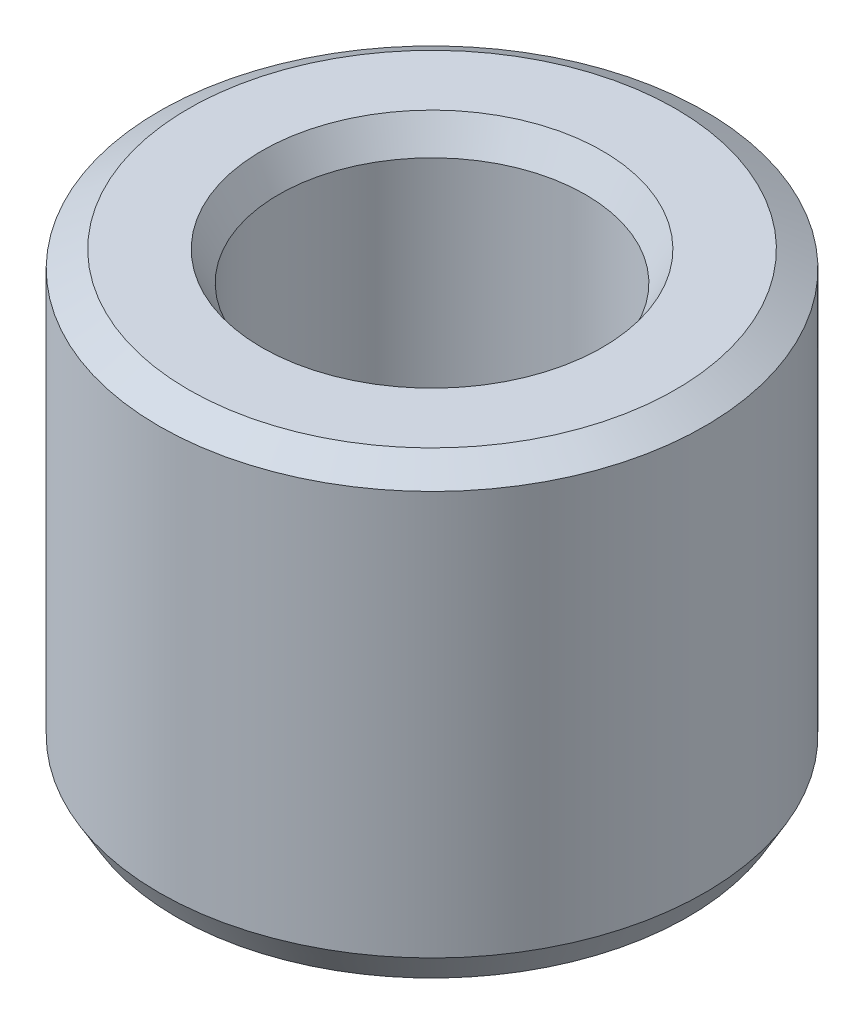
ISO-10303-21;
HEADER;
FILE_DESCRIPTION(('STEP AP214'),'2;1');
FILE_NAME('part.step','',(''),(''),'','','');
FILE_SCHEMA(('AUTOMOTIVE_DESIGN { 1 0 10303 214 1 1 1 1 }'));
ENDSEC;
DATA;
#1=APPLICATION_CONTEXT('core data for automotive mechanical design processes');
#2=APPLICATION_PROTOCOL_DEFINITION('international standard','automotive_design',2000,#1);
#3=PRODUCT_CONTEXT('',#1,'mechanical');
#4=PRODUCT('Part','Part','',(#3));
#5=PRODUCT_RELATED_PRODUCT_CATEGORY('part','',(#4));
#6=PRODUCT_DEFINITION_FORMATION('','',#4);
#7=PRODUCT_DEFINITION_CONTEXT('part definition',#1,'design');
#8=PRODUCT_DEFINITION('design','',#6,#7);
#9=PRODUCT_DEFINITION_SHAPE('','',#8);
#10=(LENGTH_UNIT() NAMED_UNIT(*) SI_UNIT(.MILLI.,.METRE.));
#11=(NAMED_UNIT(*) PLANE_ANGLE_UNIT() SI_UNIT($,.RADIAN.));
#12=(NAMED_UNIT(*) SI_UNIT($,.STERADIAN.) SOLID_ANGLE_UNIT());
#13=UNCERTAINTY_MEASURE_WITH_UNIT(LENGTH_MEASURE(1.E-05),#10,'distance_accuracy_value','');
#14=(GEOMETRIC_REPRESENTATION_CONTEXT(3) GLOBAL_UNCERTAINTY_ASSIGNED_CONTEXT((#13)) GLOBAL_UNIT_ASSIGNED_CONTEXT((#10,
#11,#12)) REPRESENTATION_CONTEXT('',''));
#15=CARTESIAN_POINT('',(0.,0.,0.));
#16=DIRECTION('',(0.,0.,1.));
#17=DIRECTION('',(1.,0.,0.));
#18=AXIS2_PLACEMENT_3D('',#15,#16,#17);
#19=CARTESIAN_POINT('',(0.,78.3973952049139,0.));
#20=DIRECTION('',(0.,-1.,0.));
#21=DIRECTION('',(0.,0.,-1.));
#22=AXIS2_PLACEMENT_3D('',#19,#20,#21);
#23=CYLINDRICAL_SURFACE('',#22,47.5);
#24=CARTESIAN_POINT('',(0.,5.11065003332639,0.));
#25=DIRECTION('',(0.,1.,0.));
#26=DIRECTION('',(0.,0.,1.));
#27=AXIS2_PLACEMENT_3D('',#24,#25,#26);
#28=CIRCLE('',#27,47.5);
#29=CARTESIAN_POINT('',(0.,5.11065003332639,47.5));
#30=VERTEX_POINT('',#29);
#31=EDGE_CURVE('E10',#30,#30,#28,.T.);
#32=ORIENTED_EDGE('',*,*,#31,.T.);
#33=EDGE_LOOP('',(#32));
#34=FACE_BOUND('',#33,.T.);
#35=CARTESIAN_POINT('',(0.,75.4467600324389,0.));
#36=DIRECTION('',(0.,1.,0.));
#37=DIRECTION('',(0.,0.,1.));
#38=AXIS2_PLACEMENT_3D('',#35,#36,#37);
#39=CIRCLE('',#38,47.5);
#40=CARTESIAN_POINT('',(0.,75.4467600324389,47.5));
#41=VERTEX_POINT('',#40);
#42=EDGE_CURVE('E50',#41,#41,#39,.F.);
#43=ORIENTED_EDGE('',*,*,#42,.T.);
#44=EDGE_LOOP('',(#43));
#45=FACE_BOUND('',#44,.T.);
#46=ADVANCED_FACE('F39',(#34,#45),#23,.T.);
#47=CARTESIAN_POINT('',(0.,78.3973952049139,0.));
#48=DIRECTION('',(0.,1.,0.));
#49=DIRECTION('',(0.,0.,1.));
#50=AXIS2_PLACEMENT_3D('',#47,#48,#49);
#51=PLANE('',#50);
#52=CARTESIAN_POINT('',(0.,78.3973952049139,0.));
#53=DIRECTION('',(0.,1.,0.));
#54=DIRECTION('',(0.,0.,1.));
#55=AXIS2_PLACEMENT_3D('',#52,#53,#54);
#56=CIRCLE('',#55,29.6501871342682);
#57=CARTESIAN_POINT('',(0.,78.3973952049139,29.6501871342682));
#58=VERTEX_POINT('',#57);
#59=EDGE_CURVE('E58',#58,#58,#56,.F.);
#60=ORIENTED_EDGE('',*,*,#59,.T.);
#61=EDGE_LOOP('',(#60));
#62=FACE_BOUND('',#61,.T.);
#63=CARTESIAN_POINT('',(0.,78.3973952049139,0.));
#64=DIRECTION('',(0.,1.,0.));
#65=DIRECTION('',(0.,0.,1.));
#66=AXIS2_PLACEMENT_3D('',#63,#64,#65);
#67=CIRCLE('',#66,42.3893499666736);
#68=CARTESIAN_POINT('',(0.,78.3973952049139,42.3893499666736));
#69=VERTEX_POINT('',#68);
#70=EDGE_CURVE('E61',#69,#69,#67,.T.);
#71=ORIENTED_EDGE('',*,*,#70,.T.);
#72=EDGE_LOOP('',(#71));
#73=FACE_BOUND('',#72,.T.);
#74=ADVANCED_FACE('F88',(#62,#73),#51,.T.);
#75=CARTESIAN_POINT('',(0.,0.,0.));
#76=DIRECTION('',(0.,1.,0.));
#77=DIRECTION('',(0.,0.,1.));
#78=AXIS2_PLACEMENT_3D('',#75,#76,#77);
#79=PLANE('',#78);
#80=CARTESIAN_POINT('',(0.,0.,0.));
#81=DIRECTION('',(0.,1.,0.));
#82=DIRECTION('',(0.,0.,1.));
#83=AXIS2_PLACEMENT_3D('',#80,#81,#82);
#84=CIRCLE('',#83,31.8102019951196);
#85=CARTESIAN_POINT('',(0.,0.,31.8102019951196));
#86=VERTEX_POINT('',#85);
#87=EDGE_CURVE('E51',#86,#86,#84,.T.);
#88=ORIENTED_EDGE('',*,*,#87,.T.);
#89=EDGE_LOOP('',(#88));
#90=FACE_BOUND('',#89,.T.);
#91=CARTESIAN_POINT('',(0.,0.,0.));
#92=DIRECTION('',(0.,1.,0.));
#93=DIRECTION('',(0.,0.,1.));
#94=AXIS2_PLACEMENT_3D('',#91,#92,#93);
#95=CIRCLE('',#94,44.549364827525);
#96=CARTESIAN_POINT('',(0.,0.,44.549364827525));
#97=VERTEX_POINT('',#96);
#98=EDGE_CURVE('E54',#97,#97,#95,.F.);
#99=ORIENTED_EDGE('',*,*,#98,.T.);
#100=EDGE_LOOP('',(#99));
#101=FACE_BOUND('',#100,.T.);
#102=ADVANCED_FACE('F83',(#90,#101),#79,.F.);
#103=CARTESIAN_POINT('',(0.,78.3973952049139,0.));
#104=DIRECTION('',(0.,-1.,0.));
#105=DIRECTION('',(0.,0.,-1.));
#106=AXIS2_PLACEMENT_3D('',#103,#104,#105);
#107=CYLINDRICAL_SURFACE('',#106,26.6995519617932);
#108=CARTESIAN_POINT('',(0.,73.2867451715875,0.));
#109=DIRECTION('',(0.,1.,0.));
#110=DIRECTION('',(0.,0.,1.));
#111=AXIS2_PLACEMENT_3D('',#108,#109,#110);
#112=CIRCLE('',#111,26.6995519617932);
#113=CARTESIAN_POINT('',(0.,73.2867451715875,26.6995519617932));
#114=VERTEX_POINT('',#113);
#115=EDGE_CURVE('E67',#114,#114,#112,.T.);
#116=ORIENTED_EDGE('',*,*,#115,.T.);
#117=EDGE_LOOP('',(#116));
#118=FACE_BOUND('',#117,.T.);
#119=CARTESIAN_POINT('',(0.,2.95063517247501,0.));
#120=DIRECTION('',(0.,1.,0.));
#121=DIRECTION('',(0.,0.,1.));
#122=AXIS2_PLACEMENT_3D('',#119,#120,#121);
#123=CIRCLE('',#122,26.6995519617932);
#124=CARTESIAN_POINT('',(0.,2.95063517247501,26.6995519617932));
#125=VERTEX_POINT('',#124);
#126=EDGE_CURVE('E69',#125,#125,#123,.F.);
#127=ORIENTED_EDGE('',*,*,#126,.T.);
#128=EDGE_LOOP('',(#127));
#129=FACE_BOUND('',#128,.T.);
#130=ADVANCED_FACE('F71',(#118,#129),#107,.F.);
#131=CARTESIAN_POINT('',(0.,73.2867451715875,0.));
#132=DIRECTION('',(0.,1.,0.));
#133=DIRECTION('',(0.,0.,1.));
#134=AXIS2_PLACEMENT_3D('',#131,#132,#133);
#135=CONICAL_SURFACE('',#134,26.6995519617932,0.523598775598301);
#136=ORIENTED_EDGE('',*,*,#59,.F.);
#137=EDGE_LOOP('',(#136));
#138=FACE_BOUND('',#137,.T.);
#139=ORIENTED_EDGE('',*,*,#115,.F.);
#140=EDGE_LOOP('',(#139));
#141=FACE_BOUND('',#140,.T.);
#142=ADVANCED_FACE('F77',(#138,#141),#135,.F.);
#143=CARTESIAN_POINT('',(0.,0.,0.));
#144=DIRECTION('',(0.,-1.,0.));
#145=DIRECTION('',(0.,0.,-1.));
#146=AXIS2_PLACEMENT_3D('',#143,#144,#145);
#147=CONICAL_SURFACE('',#146,31.8102019951196,1.04719755119659);
#148=ORIENTED_EDGE('',*,*,#126,.F.);
#149=EDGE_LOOP('',(#148));
#150=FACE_BOUND('',#149,.T.);
#151=ORIENTED_EDGE('',*,*,#87,.F.);
#152=EDGE_LOOP('',(#151));
#153=FACE_BOUND('',#152,.T.);
#154=ADVANCED_FACE('F73',(#150,#153),#147,.F.);
#155=CARTESIAN_POINT('',(0.,5.11065003332639,0.));
#156=DIRECTION('',(0.,1.,0.));
#157=DIRECTION('',(0.,0.,1.));
#158=AXIS2_PLACEMENT_3D('',#155,#156,#157);
#159=CONICAL_SURFACE('',#158,47.5,0.523598775598301);
#160=ORIENTED_EDGE('',*,*,#98,.F.);
#161=EDGE_LOOP('',(#160));
#162=FACE_BOUND('',#161,.T.);
#163=ORIENTED_EDGE('',*,*,#31,.F.);
#164=EDGE_LOOP('',(#163));
#165=FACE_BOUND('',#164,.T.);
#166=ADVANCED_FACE('F76',(#162,#165),#159,.T.);
#167=CARTESIAN_POINT('',(0.,78.3973952049139,0.));
#168=DIRECTION('',(0.,-1.,0.));
#169=DIRECTION('',(0.,0.,-1.));
#170=AXIS2_PLACEMENT_3D('',#167,#168,#169);
#171=CONICAL_SURFACE('',#170,42.3893499666736,1.0471975511966);
#172=ORIENTED_EDGE('',*,*,#42,.F.);
#173=EDGE_LOOP('',(#172));
#174=FACE_BOUND('',#173,.T.);
#175=ORIENTED_EDGE('',*,*,#70,.F.);
#176=EDGE_LOOP('',(#175));
#177=FACE_BOUND('',#176,.T.);
#178=ADVANCED_FACE('F45',(#174,#177),#171,.T.);
#179=CLOSED_SHELL('',(#46,#74,#102,#130,#142,#154,#166,#178));
#180=MANIFOLD_SOLID_BREP('B2',#179);
#181=ADVANCED_BREP_SHAPE_REPRESENTATION('',(#18,#180),#14);
#182=SHAPE_DEFINITION_REPRESENTATION(#9,#181);
ENDSEC;
END-ISO-10303-21;
